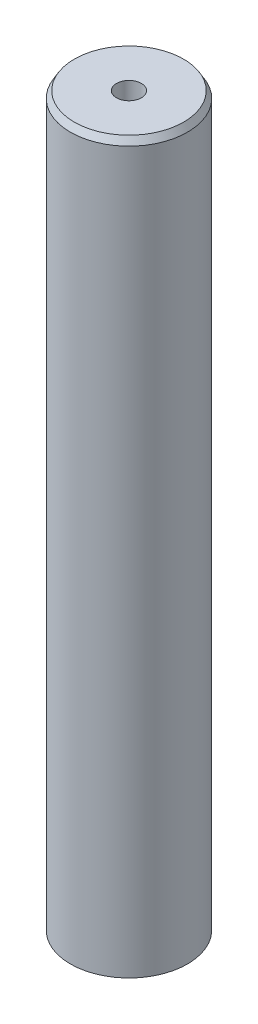
ISO-10303-21;
HEADER;
FILE_DESCRIPTION(('STEP AP214'),'2;1');
FILE_NAME('part.step','',(''),(''),'','','');
FILE_SCHEMA(('AUTOMOTIVE_DESIGN { 1 0 10303 214 1 1 1 1 }'));
ENDSEC;
DATA;
#1=APPLICATION_CONTEXT('core data for automotive mechanical design processes');
#2=APPLICATION_PROTOCOL_DEFINITION('international standard','automotive_design',2000,#1);
#3=PRODUCT_CONTEXT('',#1,'mechanical');
#4=PRODUCT('Part','Part','',(#3));
#5=PRODUCT_RELATED_PRODUCT_CATEGORY('part','',(#4));
#6=PRODUCT_DEFINITION_FORMATION('','',#4);
#7=PRODUCT_DEFINITION_CONTEXT('part definition',#1,'design');
#8=PRODUCT_DEFINITION('design','',#6,#7);
#9=PRODUCT_DEFINITION_SHAPE('','',#8);
#10=(LENGTH_UNIT() NAMED_UNIT(*) SI_UNIT(.MILLI.,.METRE.));
#11=(NAMED_UNIT(*) PLANE_ANGLE_UNIT() SI_UNIT($,.RADIAN.));
#12=(NAMED_UNIT(*) SI_UNIT($,.STERADIAN.) SOLID_ANGLE_UNIT());
#13=UNCERTAINTY_MEASURE_WITH_UNIT(LENGTH_MEASURE(1.E-05),#10,'distance_accuracy_value','');
#14=(GEOMETRIC_REPRESENTATION_CONTEXT(3) GLOBAL_UNCERTAINTY_ASSIGNED_CONTEXT((#13)) GLOBAL_UNIT_ASSIGNED_CONTEXT((#10,
#11,#12)) REPRESENTATION_CONTEXT('',''));
#15=CARTESIAN_POINT('',(0.,0.,0.));
#16=DIRECTION('',(0.,0.,1.));
#17=DIRECTION('',(1.,0.,0.));
#18=AXIS2_PLACEMENT_3D('',#15,#16,#17);
#19=CARTESIAN_POINT('',(0.,62.4386150927144,0.));
#20=DIRECTION('',(0.,-1.,0.));
#21=DIRECTION('',(0.,0.,-1.));
#22=AXIS2_PLACEMENT_3D('',#19,#20,#21);
#23=CYLINDRICAL_SURFACE('',#22,5.);
#24=CARTESIAN_POINT('',(0.,61.8624206870109,0.));
#25=DIRECTION('',(0.,1.,0.));
#26=DIRECTION('',(0.,0.,1.));
#27=AXIS2_PLACEMENT_3D('',#24,#25,#26);
#28=CIRCLE('',#27,5.);
#29=CARTESIAN_POINT('',(0.,61.8624206870109,5.));
#30=VERTEX_POINT('',#29);
#31=EDGE_CURVE('E50',#30,#30,#28,.F.);
#32=ORIENTED_EDGE('',*,*,#31,.T.);
#33=EDGE_LOOP('',(#32));
#34=FACE_BOUND('',#33,.T.);
#35=CARTESIAN_POINT('',(0.,0.332665995238457,0.));
#36=DIRECTION('',(0.,1.,0.));
#37=DIRECTION('',(0.,0.,1.));
#38=AXIS2_PLACEMENT_3D('',#35,#36,#37);
#39=CIRCLE('',#38,5.);
#40=CARTESIAN_POINT('',(0.,0.332665995238457,5.));
#41=VERTEX_POINT('',#40);
#42=EDGE_CURVE('E51',#41,#41,#39,.T.);
#43=ORIENTED_EDGE('',*,*,#42,.T.);
#44=EDGE_LOOP('',(#43));
#45=FACE_BOUND('',#44,.T.);
#46=ADVANCED_FACE('F39',(#34,#45),#23,.T.);
#47=CARTESIAN_POINT('',(0.,62.4386150927144,0.));
#48=DIRECTION('',(0.,1.,0.));
#49=DIRECTION('',(0.,0.,1.));
#50=AXIS2_PLACEMENT_3D('',#47,#48,#49);
#51=PLANE('',#50);
#52=CARTESIAN_POINT('',(0.,62.4386150927144,0.));
#53=DIRECTION('',(0.,1.,0.));
#54=DIRECTION('',(0.,0.,1.));
#55=AXIS2_PLACEMENT_3D('',#52,#53,#54);
#56=CIRCLE('',#55,4.66733400476154);
#57=CARTESIAN_POINT('',(0.,62.4386150927144,4.66733400476154));
#58=VERTEX_POINT('',#57);
#59=EDGE_CURVE('E54',#58,#58,#56,.T.);
#60=ORIENTED_EDGE('',*,*,#59,.T.);
#61=EDGE_LOOP('',(#60));
#62=FACE_BOUND('',#61,.T.);
#63=CARTESIAN_POINT('',(0.,62.4386150927144,0.));
#64=DIRECTION('',(0.,1.,0.));
#65=DIRECTION('',(0.,0.,1.));
#66=AXIS2_PLACEMENT_3D('',#63,#64,#65);
#67=CIRCLE('',#66,1.065163829498);
#68=CARTESIAN_POINT('',(0.,62.4386150927144,1.065163829498));
#69=VERTEX_POINT('',#68);
#70=EDGE_CURVE('E58',#69,#69,#67,.T.);
#71=ORIENTED_EDGE('',*,*,#70,.F.);
#72=EDGE_LOOP('',(#71));
#73=FACE_BOUND('',#72,.T.);
#74=ADVANCED_FACE('F69',(#62,#73),#51,.T.);
#75=CARTESIAN_POINT('',(0.,0.,0.));
#76=DIRECTION('',(0.,1.,0.));
#77=DIRECTION('',(0.,0.,1.));
#78=AXIS2_PLACEMENT_3D('',#75,#76,#77);
#79=PLANE('',#78);
#80=CARTESIAN_POINT('',(0.,0.,0.));
#81=DIRECTION('',(0.,1.,0.));
#82=DIRECTION('',(0.,0.,1.));
#83=AXIS2_PLACEMENT_3D('',#80,#81,#82);
#84=CIRCLE('',#83,4.42380559429652);
#85=CARTESIAN_POINT('',(0.,0.,4.42380559429652));
#86=VERTEX_POINT('',#85);
#87=EDGE_CURVE('E10',#86,#86,#84,.F.);
#88=ORIENTED_EDGE('',*,*,#87,.T.);
#89=EDGE_LOOP('',(#88));
#90=FACE_BOUND('',#89,.T.);
#91=CARTESIAN_POINT('',(0.,0.,0.));
#92=DIRECTION('',(0.,1.,0.));
#93=DIRECTION('',(0.,0.,1.));
#94=AXIS2_PLACEMENT_3D('',#91,#92,#93);
#95=CIRCLE('',#94,1.065163829498);
#96=CARTESIAN_POINT('',(0.,0.,1.065163829498));
#97=VERTEX_POINT('',#96);
#98=EDGE_CURVE('E63',#97,#97,#95,.T.);
#99=ORIENTED_EDGE('',*,*,#98,.T.);
#100=EDGE_LOOP('',(#99));
#101=FACE_BOUND('',#100,.T.);
#102=ADVANCED_FACE('F75',(#90,#101),#79,.F.);
#103=CARTESIAN_POINT('',(0.,62.4386150927144,0.));
#104=DIRECTION('',(0.,-1.,0.));
#105=DIRECTION('',(0.,0.,-1.));
#106=AXIS2_PLACEMENT_3D('',#103,#104,#105);
#107=CYLINDRICAL_SURFACE('',#106,1.065163829498);
#108=ORIENTED_EDGE('',*,*,#70,.T.);
#109=EDGE_LOOP('',(#108));
#110=FACE_BOUND('',#109,.T.);
#111=ORIENTED_EDGE('',*,*,#98,.F.);
#112=EDGE_LOOP('',(#111));
#113=FACE_BOUND('',#112,.T.);
#114=ADVANCED_FACE('F70',(#110,#113),#107,.F.);
#115=CARTESIAN_POINT('',(0.,62.4386150927144,0.));
#116=DIRECTION('',(0.,-1.,0.));
#117=DIRECTION('',(0.,0.,-1.));
#118=AXIS2_PLACEMENT_3D('',#115,#116,#117);
#119=CONICAL_SURFACE('',#118,4.66733400476154,0.523598775598292);
#120=ORIENTED_EDGE('',*,*,#31,.F.);
#121=EDGE_LOOP('',(#120));
#122=FACE_BOUND('',#121,.T.);
#123=ORIENTED_EDGE('',*,*,#59,.F.);
#124=EDGE_LOOP('',(#123));
#125=FACE_BOUND('',#124,.T.);
#126=ADVANCED_FACE('F81',(#122,#125),#119,.T.);
#127=CARTESIAN_POINT('',(0.,0.332665995238457,0.));
#128=DIRECTION('',(0.,1.,0.));
#129=DIRECTION('',(0.,0.,1.));
#130=AXIS2_PLACEMENT_3D('',#127,#128,#129);
#131=CONICAL_SURFACE('',#130,5.,1.0471975511966);
#132=ORIENTED_EDGE('',*,*,#87,.F.);
#133=EDGE_LOOP('',(#132));
#134=FACE_BOUND('',#133,.T.);
#135=ORIENTED_EDGE('',*,*,#42,.F.);
#136=EDGE_LOOP('',(#135));
#137=FACE_BOUND('',#136,.T.);
#138=ADVANCED_FACE('F45',(#134,#137),#131,.T.);
#139=CLOSED_SHELL('',(#46,#74,#102,#114,#126,#138));
#140=MANIFOLD_SOLID_BREP('B2',#139);
#141=ADVANCED_BREP_SHAPE_REPRESENTATION('',(#18,#140),#14);
#142=SHAPE_DEFINITION_REPRESENTATION(#9,#141);
ENDSEC;
END-ISO-10303-21;
